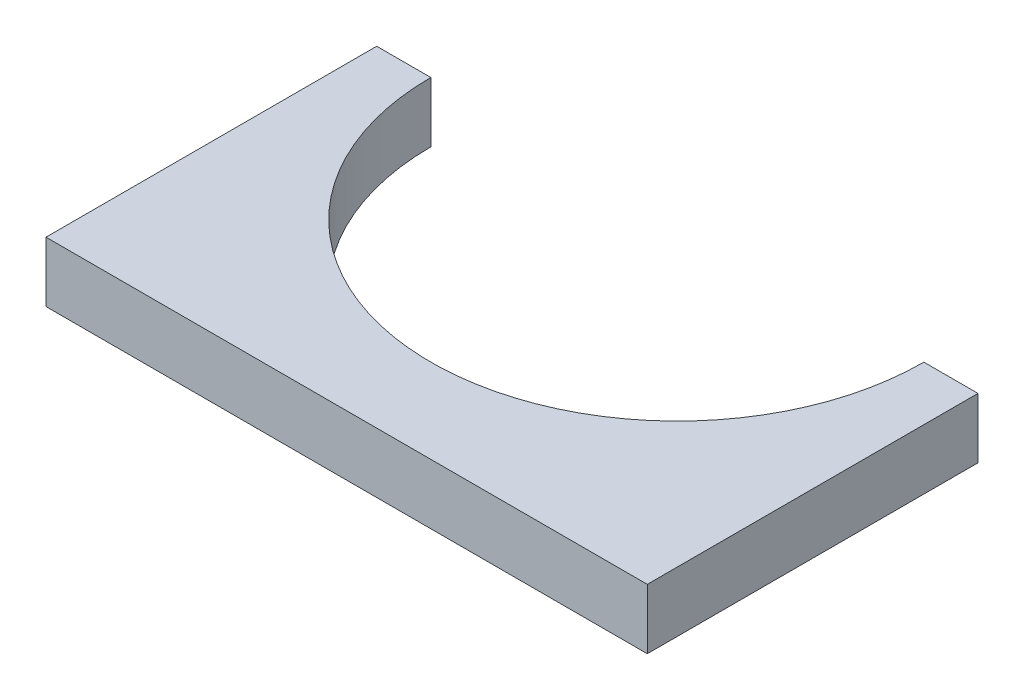
ISO-10303-21;
HEADER;
FILE_DESCRIPTION(('STEP AP214'),'2;1');
FILE_NAME('part.step','',(''),(''),'','','');
FILE_SCHEMA(('AUTOMOTIVE_DESIGN { 1 0 10303 214 1 1 1 1 }'));
ENDSEC;
DATA;
#1=APPLICATION_CONTEXT('core data for automotive mechanical design processes');
#2=APPLICATION_PROTOCOL_DEFINITION('international standard','automotive_design',2000,#1);
#3=PRODUCT_CONTEXT('',#1,'mechanical');
#4=PRODUCT('Part','Part','',(#3));
#5=PRODUCT_RELATED_PRODUCT_CATEGORY('part','',(#4));
#6=PRODUCT_DEFINITION_FORMATION('','',#4);
#7=PRODUCT_DEFINITION_CONTEXT('part definition',#1,'design');
#8=PRODUCT_DEFINITION('design','',#6,#7);
#9=PRODUCT_DEFINITION_SHAPE('','',#8);
#10=(LENGTH_UNIT() NAMED_UNIT(*) SI_UNIT(.MILLI.,.METRE.));
#11=(NAMED_UNIT(*) PLANE_ANGLE_UNIT() SI_UNIT($,.RADIAN.));
#12=(NAMED_UNIT(*) SI_UNIT($,.STERADIAN.) SOLID_ANGLE_UNIT());
#13=UNCERTAINTY_MEASURE_WITH_UNIT(LENGTH_MEASURE(1.E-05),#10,'distance_accuracy_value','');
#14=(GEOMETRIC_REPRESENTATION_CONTEXT(3) GLOBAL_UNCERTAINTY_ASSIGNED_CONTEXT((#13)) GLOBAL_UNIT_ASSIGNED_CONTEXT((#10,
#11,#12)) REPRESENTATION_CONTEXT('',''));
#15=CARTESIAN_POINT('',(0.,0.,0.));
#16=DIRECTION('',(0.,0.,1.));
#17=DIRECTION('',(1.,0.,0.));
#18=AXIS2_PLACEMENT_3D('',#15,#16,#17);
#19=CARTESIAN_POINT('',(-100.,20.,-110.));
#20=DIRECTION('',(1.,0.,0.));
#21=DIRECTION('',(0.,0.,-1.));
#22=AXIS2_PLACEMENT_3D('',#19,#20,#21);
#23=PLANE('',#22);
#24=DIRECTION('',(0.,0.,1.));
#25=VECTOR('',#24,1.);
#26=CARTESIAN_POINT('',(-100.,0.,-110.));
#27=LINE('',#26,#25);
#28=CARTESIAN_POINT('',(-100.,0.,-110.));
#29=VERTEX_POINT('',#28);
#30=CARTESIAN_POINT('',(-100.,0.,0.));
#31=VERTEX_POINT('',#30);
#32=EDGE_CURVE('E128',#29,#31,#27,.T.);
#33=ORIENTED_EDGE('',*,*,#32,.T.);
#34=DIRECTION('',(0.,-1.,0.));
#35=VECTOR('',#34,1.);
#36=CARTESIAN_POINT('',(-100.,20.,0.));
#37=LINE('',#36,#35);
#38=CARTESIAN_POINT('',(-100.,20.,0.));
#39=VERTEX_POINT('',#38);
#40=EDGE_CURVE('E11',#39,#31,#37,.T.);
#41=ORIENTED_EDGE('',*,*,#40,.F.);
#42=DIRECTION('',(0.,0.,1.));
#43=VECTOR('',#42,1.);
#44=CARTESIAN_POINT('',(-100.,20.,-110.));
#45=LINE('',#44,#43);
#46=CARTESIAN_POINT('',(-100.,20.,-110.));
#47=VERTEX_POINT('',#46);
#48=EDGE_CURVE('E144',#47,#39,#45,.T.);
#49=ORIENTED_EDGE('',*,*,#48,.F.);
#50=DIRECTION('',(0.,-1.,0.));
#51=VECTOR('',#50,1.);
#52=CARTESIAN_POINT('',(-100.,20.,-110.));
#53=LINE('',#52,#51);
#54=EDGE_CURVE('E124',#47,#29,#53,.T.);
#55=ORIENTED_EDGE('',*,*,#54,.T.);
#56=EDGE_LOOP('',(#33,#41,#49,#55));
#57=FACE_BOUND('',#56,.T.);
#58=ADVANCED_FACE('F39',(#57),#23,.F.);
#59=CARTESIAN_POINT('',(-100.,20.,0.));
#60=DIRECTION('',(0.,0.,-1.));
#61=DIRECTION('',(-1.,0.,0.));
#62=AXIS2_PLACEMENT_3D('',#59,#60,#61);
#63=PLANE('',#62);
#64=DIRECTION('',(1.,0.,0.));
#65=VECTOR('',#64,1.);
#66=CARTESIAN_POINT('',(-100.,0.,0.));
#67=LINE('',#66,#65);
#68=CARTESIAN_POINT('',(100.,0.,0.));
#69=VERTEX_POINT('',#68);
#70=EDGE_CURVE('E132',#31,#69,#67,.T.);
#71=ORIENTED_EDGE('',*,*,#70,.T.);
#72=DIRECTION('',(0.,-1.,0.));
#73=VECTOR('',#72,1.);
#74=CARTESIAN_POINT('',(100.,20.,0.));
#75=LINE('',#74,#73);
#76=CARTESIAN_POINT('',(100.,20.,0.));
#77=VERTEX_POINT('',#76);
#78=EDGE_CURVE('E48',#77,#69,#75,.T.);
#79=ORIENTED_EDGE('',*,*,#78,.F.);
#80=DIRECTION('',(1.,0.,0.));
#81=VECTOR('',#80,1.);
#82=CARTESIAN_POINT('',(-100.,20.,0.));
#83=LINE('',#82,#81);
#84=EDGE_CURVE('E93',#39,#77,#83,.T.);
#85=ORIENTED_EDGE('',*,*,#84,.F.);
#86=ORIENTED_EDGE('',*,*,#40,.T.);
#87=EDGE_LOOP('',(#71,#79,#85,#86));
#88=FACE_BOUND('',#87,.T.);
#89=ADVANCED_FACE('F172',(#88),#63,.F.);
#90=CARTESIAN_POINT('',(100.,20.,-110.));
#91=DIRECTION('',(-1.,0.,0.));
#92=DIRECTION('',(0.,0.,1.));
#93=AXIS2_PLACEMENT_3D('',#90,#91,#92);
#94=PLANE('',#93);
#95=DIRECTION('',(0.,0.,-1.));
#96=VECTOR('',#95,1.);
#97=CARTESIAN_POINT('',(100.,0.,-110.));
#98=LINE('',#97,#96);
#99=CARTESIAN_POINT('',(100.,0.,-110.));
#100=VERTEX_POINT('',#99);
#101=EDGE_CURVE('E135',#69,#100,#98,.T.);
#102=ORIENTED_EDGE('',*,*,#101,.T.);
#103=DIRECTION('',(0.,-1.,0.));
#104=VECTOR('',#103,1.);
#105=CARTESIAN_POINT('',(100.,20.,-110.));
#106=LINE('',#105,#104);
#107=CARTESIAN_POINT('',(100.,20.,-110.));
#108=VERTEX_POINT('',#107);
#109=EDGE_CURVE('E117',#108,#100,#106,.T.);
#110=ORIENTED_EDGE('',*,*,#109,.F.);
#111=DIRECTION('',(0.,0.,-1.));
#112=VECTOR('',#111,1.);
#113=CARTESIAN_POINT('',(100.,20.,-110.));
#114=LINE('',#113,#112);
#115=EDGE_CURVE('E106',#77,#108,#114,.T.);
#116=ORIENTED_EDGE('',*,*,#115,.F.);
#117=ORIENTED_EDGE('',*,*,#78,.T.);
#118=EDGE_LOOP('',(#102,#110,#116,#117));
#119=FACE_BOUND('',#118,.T.);
#120=ADVANCED_FACE('F154',(#119),#94,.F.);
#121=CARTESIAN_POINT('',(82.,20.,-110.));
#122=DIRECTION('',(0.,0.,1.));
#123=DIRECTION('',(1.,0.,0.));
#124=AXIS2_PLACEMENT_3D('',#121,#122,#123);
#125=PLANE('',#124);
#126=DIRECTION('',(-1.,0.,0.));
#127=VECTOR('',#126,1.);
#128=CARTESIAN_POINT('',(82.,0.,-110.));
#129=LINE('',#128,#127);
#130=CARTESIAN_POINT('',(82.,0.,-110.));
#131=VERTEX_POINT('',#130);
#132=EDGE_CURVE('E115',#100,#131,#129,.T.);
#133=ORIENTED_EDGE('',*,*,#132,.T.);
#134=DIRECTION('',(0.,-1.,0.));
#135=VECTOR('',#134,1.);
#136=CARTESIAN_POINT('',(82.,20.,-110.));
#137=LINE('',#136,#135);
#138=CARTESIAN_POINT('',(82.,20.,-110.));
#139=VERTEX_POINT('',#138);
#140=EDGE_CURVE('E112',#139,#131,#137,.T.);
#141=ORIENTED_EDGE('',*,*,#140,.F.);
#142=DIRECTION('',(-1.,0.,0.));
#143=VECTOR('',#142,1.);
#144=CARTESIAN_POINT('',(82.,20.,-110.));
#145=LINE('',#144,#143);
#146=EDGE_CURVE('E100',#108,#139,#145,.T.);
#147=ORIENTED_EDGE('',*,*,#146,.F.);
#148=ORIENTED_EDGE('',*,*,#109,.T.);
#149=EDGE_LOOP('',(#133,#141,#147,#148));
#150=FACE_BOUND('',#149,.T.);
#151=ADVANCED_FACE('F113',(#150),#125,.F.);
#152=CARTESIAN_POINT('',(0.,20.,-110.));
#153=DIRECTION('',(0.,-1.,0.));
#154=DIRECTION('',(0.,0.,-1.));
#155=AXIS2_PLACEMENT_3D('',#152,#153,#154);
#156=CYLINDRICAL_SURFACE('',#155,82.);
#157=CARTESIAN_POINT('',(0.,0.,-110.));
#158=DIRECTION('',(0.,-1.,0.));
#159=DIRECTION('',(0.,0.,1.));
#160=AXIS2_PLACEMENT_3D('',#157,#158,#159);
#161=CIRCLE('',#160,82.);
#162=CARTESIAN_POINT('',(-82.,0.,-110.));
#163=VERTEX_POINT('',#162);
#164=EDGE_CURVE('E79',#131,#163,#161,.T.);
#165=ORIENTED_EDGE('',*,*,#164,.T.);
#166=DIRECTION('',(0.,-1.,0.));
#167=VECTOR('',#166,1.);
#168=CARTESIAN_POINT('',(-82.,20.,-110.));
#169=LINE('',#168,#167);
#170=CARTESIAN_POINT('',(-82.,20.,-110.));
#171=VERTEX_POINT('',#170);
#172=EDGE_CURVE('E118',#171,#163,#169,.T.);
#173=ORIENTED_EDGE('',*,*,#172,.F.);
#174=CARTESIAN_POINT('',(0.,20.,-110.));
#175=DIRECTION('',(0.,-1.,0.));
#176=DIRECTION('',(0.,0.,1.));
#177=AXIS2_PLACEMENT_3D('',#174,#175,#176);
#178=CIRCLE('',#177,82.);
#179=EDGE_CURVE('E104',#139,#171,#178,.T.);
#180=ORIENTED_EDGE('',*,*,#179,.F.);
#181=ORIENTED_EDGE('',*,*,#140,.T.);
#182=EDGE_LOOP('',(#165,#173,#180,#181));
#183=FACE_BOUND('',#182,.T.);
#184=ADVANCED_FACE('F120',(#183),#156,.F.);
#185=CARTESIAN_POINT('',(-82.,20.,-110.));
#186=DIRECTION('',(0.,0.,1.));
#187=DIRECTION('',(1.,0.,0.));
#188=AXIS2_PLACEMENT_3D('',#185,#186,#187);
#189=PLANE('',#188);
#190=DIRECTION('',(-1.,0.,0.));
#191=VECTOR('',#190,1.);
#192=CARTESIAN_POINT('',(-82.,0.,-110.));
#193=LINE('',#192,#191);
#194=EDGE_CURVE('E85',#163,#29,#193,.T.);
#195=ORIENTED_EDGE('',*,*,#194,.T.);
#196=ORIENTED_EDGE('',*,*,#54,.F.);
#197=DIRECTION('',(-1.,0.,0.));
#198=VECTOR('',#197,1.);
#199=CARTESIAN_POINT('',(-82.,20.,-110.));
#200=LINE('',#199,#198);
#201=EDGE_CURVE('E56',#171,#47,#200,.T.);
#202=ORIENTED_EDGE('',*,*,#201,.F.);
#203=ORIENTED_EDGE('',*,*,#172,.T.);
#204=EDGE_LOOP('',(#195,#196,#202,#203));
#205=FACE_BOUND('',#204,.T.);
#206=ADVANCED_FACE('F161',(#205),#189,.F.);
#207=CARTESIAN_POINT('',(0.,20.,-110.));
#208=DIRECTION('',(0.,1.,0.));
#209=DIRECTION('',(0.,0.,1.));
#210=AXIS2_PLACEMENT_3D('',#207,#208,#209);
#211=PLANE('',#210);
#212=ORIENTED_EDGE('',*,*,#48,.T.);
#213=ORIENTED_EDGE('',*,*,#84,.T.);
#214=ORIENTED_EDGE('',*,*,#115,.T.);
#215=ORIENTED_EDGE('',*,*,#146,.T.);
#216=ORIENTED_EDGE('',*,*,#179,.T.);
#217=ORIENTED_EDGE('',*,*,#201,.T.);
#218=EDGE_LOOP('',(#212,#213,#214,#215,#216,#217));
#219=FACE_BOUND('',#218,.T.);
#220=ADVANCED_FACE('F102',(#219),#211,.T.);
#221=CARTESIAN_POINT('',(0.,0.,-110.));
#222=DIRECTION('',(0.,1.,0.));
#223=DIRECTION('',(0.,0.,1.));
#224=AXIS2_PLACEMENT_3D('',#221,#222,#223);
#225=PLANE('',#224);
#226=ORIENTED_EDGE('',*,*,#32,.F.);
#227=ORIENTED_EDGE('',*,*,#194,.F.);
#228=ORIENTED_EDGE('',*,*,#164,.F.);
#229=ORIENTED_EDGE('',*,*,#132,.F.);
#230=ORIENTED_EDGE('',*,*,#101,.F.);
#231=ORIENTED_EDGE('',*,*,#70,.F.);
#232=EDGE_LOOP('',(#226,#227,#228,#229,#230,#231));
#233=FACE_BOUND('',#232,.T.);
#234=ADVANCED_FACE('F157',(#233),#225,.F.);
#235=CLOSED_SHELL('',(#58,#89,#120,#151,#184,#206,#220,#234));
#236=MANIFOLD_SOLID_BREP('B2',#235);
#237=ADVANCED_BREP_SHAPE_REPRESENTATION('',(#18,#236),#14);
#238=SHAPE_DEFINITION_REPRESENTATION(#9,#237);
ENDSEC;
END-ISO-10303-21;
